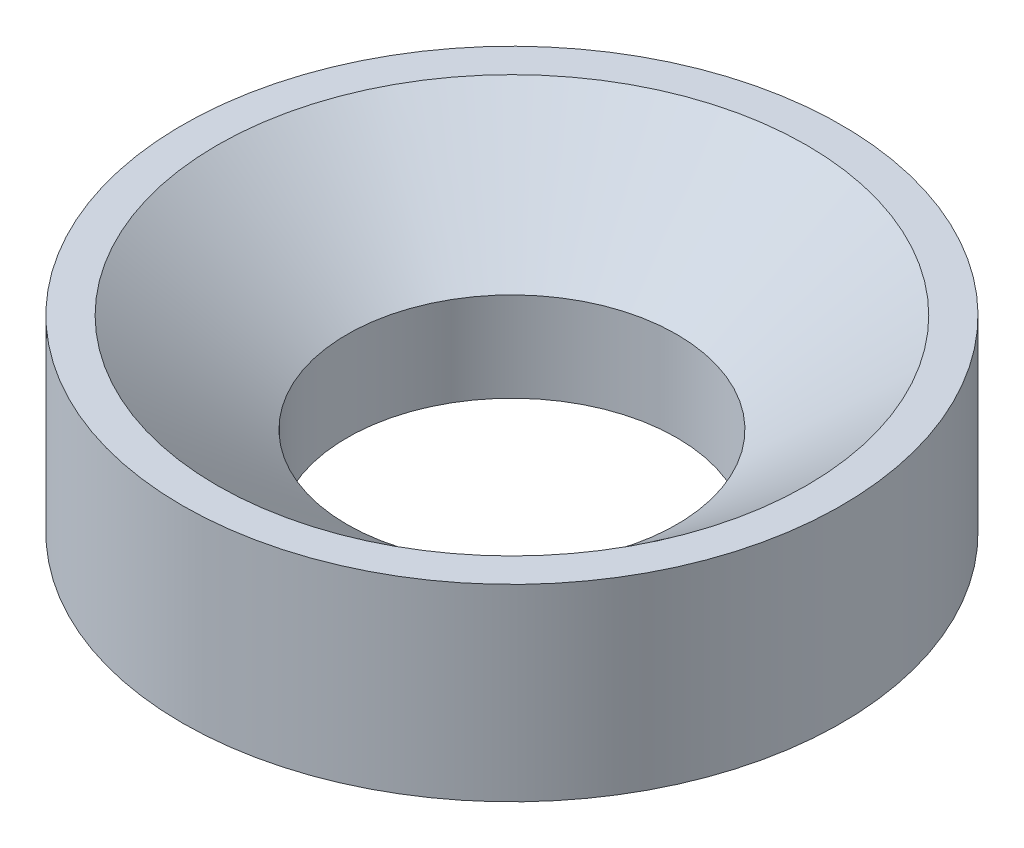
ISO-10303-21;
HEADER;
FILE_DESCRIPTION(('STEP AP214'),'2;1');
FILE_NAME('part.step','',(''),(''),'','','');
FILE_SCHEMA(('AUTOMOTIVE_DESIGN { 1 0 10303 214 1 1 1 1 }'));
ENDSEC;
DATA;
#1=APPLICATION_CONTEXT('core data for automotive mechanical design processes');
#2=APPLICATION_PROTOCOL_DEFINITION('international standard','automotive_design',2000,#1);
#3=PRODUCT_CONTEXT('',#1,'mechanical');
#4=PRODUCT('Part','Part','',(#3));
#5=PRODUCT_RELATED_PRODUCT_CATEGORY('part','',(#4));
#6=PRODUCT_DEFINITION_FORMATION('','',#4);
#7=PRODUCT_DEFINITION_CONTEXT('part definition',#1,'design');
#8=PRODUCT_DEFINITION('design','',#6,#7);
#9=PRODUCT_DEFINITION_SHAPE('','',#8);
#10=(LENGTH_UNIT() NAMED_UNIT(*) SI_UNIT(.MILLI.,.METRE.));
#11=(NAMED_UNIT(*) PLANE_ANGLE_UNIT() SI_UNIT($,.RADIAN.));
#12=(NAMED_UNIT(*) SI_UNIT($,.STERADIAN.) SOLID_ANGLE_UNIT());
#13=UNCERTAINTY_MEASURE_WITH_UNIT(LENGTH_MEASURE(1.E-05),#10,'distance_accuracy_value','');
#14=(GEOMETRIC_REPRESENTATION_CONTEXT(3) GLOBAL_UNCERTAINTY_ASSIGNED_CONTEXT((#13)) GLOBAL_UNIT_ASSIGNED_CONTEXT((#10,
#11,#12)) REPRESENTATION_CONTEXT('',''));
#15=CARTESIAN_POINT('',(0.,0.,0.));
#16=DIRECTION('',(0.,0.,1.));
#17=DIRECTION('',(1.,0.,0.));
#18=AXIS2_PLACEMENT_3D('',#15,#16,#17);
#19=CARTESIAN_POINT('',(44.45,0.,0.));
#20=DIRECTION('',(0.,1.,0.));
#21=DIRECTION('',(0.,0.,1.));
#22=AXIS2_PLACEMENT_3D('',#19,#20,#21);
#23=PLANE('',#22);
#24=CARTESIAN_POINT('',(0.,0.,0.));
#25=DIRECTION('',(0.,1.,0.));
#26=DIRECTION('',(0.,0.,1.));
#27=AXIS2_PLACEMENT_3D('',#24,#25,#26);
#28=CIRCLE('',#27,88.9);
#29=CARTESIAN_POINT('',(0.,0.,88.9));
#30=VERTEX_POINT('',#29);
#31=EDGE_CURVE('E10',#30,#30,#28,.T.);
#32=ORIENTED_EDGE('',*,*,#31,.F.);
#33=EDGE_LOOP('',(#32));
#34=FACE_BOUND('',#33,.T.);
#35=CARTESIAN_POINT('',(0.,0.,0.));
#36=DIRECTION('',(0.,1.,0.));
#37=DIRECTION('',(0.,0.,1.));
#38=AXIS2_PLACEMENT_3D('',#35,#36,#37);
#39=CIRCLE('',#38,44.45);
#40=CARTESIAN_POINT('',(0.,0.,44.45));
#41=VERTEX_POINT('',#40);
#42=EDGE_CURVE('E50',#41,#41,#39,.T.);
#43=ORIENTED_EDGE('',*,*,#42,.T.);
#44=EDGE_LOOP('',(#43));
#45=FACE_BOUND('',#44,.T.);
#46=ADVANCED_FACE('F31',(#34,#45),#23,.F.);
#47=CARTESIAN_POINT('',(0.,44.6684275184275,0.));
#48=DIRECTION('',(0.,1.,0.));
#49=DIRECTION('',(0.,0.,1.));
#50=AXIS2_PLACEMENT_3D('',#47,#48,#49);
#51=CYLINDRICAL_SURFACE('',#50,88.9);
#52=CARTESIAN_POINT('',(0.,50.8,0.));
#53=DIRECTION('',(0.,1.,0.));
#54=DIRECTION('',(0.,0.,1.));
#55=AXIS2_PLACEMENT_3D('',#52,#53,#54);
#56=CIRCLE('',#55,88.9);
#57=CARTESIAN_POINT('',(0.,50.8,88.9));
#58=VERTEX_POINT('',#57);
#59=EDGE_CURVE('E37',#58,#58,#56,.T.);
#60=ORIENTED_EDGE('',*,*,#59,.F.);
#61=EDGE_LOOP('',(#60));
#62=FACE_BOUND('',#61,.T.);
#63=ORIENTED_EDGE('',*,*,#31,.T.);
#64=EDGE_LOOP('',(#63));
#65=FACE_BOUND('',#64,.T.);
#66=ADVANCED_FACE('F69',(#62,#65),#51,.T.);
#67=CARTESIAN_POINT('',(79.5076167076167,50.8,0.));
#68=DIRECTION('',(0.,-1.,0.));
#69=DIRECTION('',(0.,0.,-1.));
#70=AXIS2_PLACEMENT_3D('',#67,#68,#69);
#71=PLANE('',#70);
#72=CARTESIAN_POINT('',(0.,50.8,0.));
#73=DIRECTION('',(0.,1.,0.));
#74=DIRECTION('',(0.,0.,1.));
#75=AXIS2_PLACEMENT_3D('',#72,#73,#74);
#76=CIRCLE('',#75,79.5076167076167);
#77=CARTESIAN_POINT('',(0.,50.8,79.5076167076167));
#78=VERTEX_POINT('',#77);
#79=EDGE_CURVE('E41',#78,#78,#76,.T.);
#80=ORIENTED_EDGE('',*,*,#79,.F.);
#81=EDGE_LOOP('',(#80));
#82=FACE_BOUND('',#81,.T.);
#83=ORIENTED_EDGE('',*,*,#59,.T.);
#84=EDGE_LOOP('',(#83));
#85=FACE_BOUND('',#84,.T.);
#86=ADVANCED_FACE('F64',(#82,#85),#71,.F.);
#87=CARTESIAN_POINT('',(0.,50.8,0.));
#88=DIRECTION('',(0.,1.,0.));
#89=DIRECTION('',(0.,0.,1.));
#90=AXIS2_PLACEMENT_3D('',#87,#88,#89);
#91=CONICAL_SURFACE('',#90,79.5076167076167,0.920564891003304);
#92=CARTESIAN_POINT('',(0.,24.1362407862408,0.));
#93=DIRECTION('',(0.,1.,0.));
#94=DIRECTION('',(0.,0.,1.));
#95=AXIS2_PLACEMENT_3D('',#92,#93,#94);
#96=CIRCLE('',#95,44.45);
#97=CARTESIAN_POINT('',(0.,24.1362407862408,44.45));
#98=VERTEX_POINT('',#97);
#99=EDGE_CURVE('E45',#98,#98,#96,.T.);
#100=ORIENTED_EDGE('',*,*,#99,.F.);
#101=EDGE_LOOP('',(#100));
#102=FACE_BOUND('',#101,.T.);
#103=ORIENTED_EDGE('',*,*,#79,.T.);
#104=EDGE_LOOP('',(#103));
#105=FACE_BOUND('',#104,.T.);
#106=ADVANCED_FACE('F58',(#102,#105),#91,.F.);
#107=CARTESIAN_POINT('',(0.,44.6684275184275,0.));
#108=DIRECTION('',(0.,1.,0.));
#109=DIRECTION('',(0.,0.,1.));
#110=AXIS2_PLACEMENT_3D('',#107,#108,#109);
#111=CYLINDRICAL_SURFACE('',#110,44.45);
#112=ORIENTED_EDGE('',*,*,#42,.F.);
#113=EDGE_LOOP('',(#112));
#114=FACE_BOUND('',#113,.T.);
#115=ORIENTED_EDGE('',*,*,#99,.T.);
#116=EDGE_LOOP('',(#115));
#117=FACE_BOUND('',#116,.T.);
#118=ADVANCED_FACE('F55',(#114,#117),#111,.F.);
#119=CLOSED_SHELL('',(#46,#66,#86,#106,#118));
#120=MANIFOLD_SOLID_BREP('B2',#119);
#121=ADVANCED_BREP_SHAPE_REPRESENTATION('',(#18,#120),#14);
#122=SHAPE_DEFINITION_REPRESENTATION(#9,#121);
ENDSEC;
END-ISO-10303-21;
